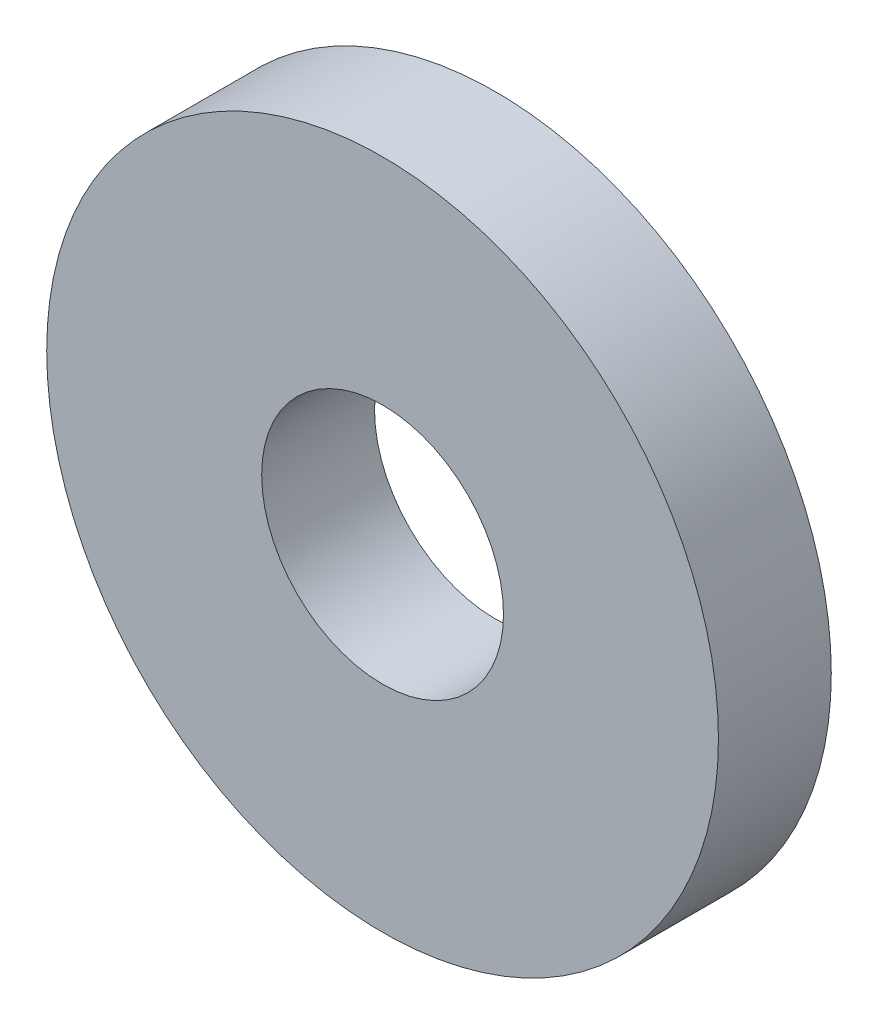
ISO-10303-21;
HEADER;
FILE_DESCRIPTION(('STEP AP214'),'2;1');
FILE_NAME('part.step','',(''),(''),'','','');
FILE_SCHEMA(('AUTOMOTIVE_DESIGN { 1 0 10303 214 1 1 1 1 }'));
ENDSEC;
DATA;
#1=APPLICATION_CONTEXT('core data for automotive mechanical design processes');
#2=APPLICATION_PROTOCOL_DEFINITION('international standard','automotive_design',2000,#1);
#3=PRODUCT_CONTEXT('',#1,'mechanical');
#4=PRODUCT('Part','Part','',(#3));
#5=PRODUCT_RELATED_PRODUCT_CATEGORY('part','',(#4));
#6=PRODUCT_DEFINITION_FORMATION('','',#4);
#7=PRODUCT_DEFINITION_CONTEXT('part definition',#1,'design');
#8=PRODUCT_DEFINITION('design','',#6,#7);
#9=PRODUCT_DEFINITION_SHAPE('','',#8);
#10=(LENGTH_UNIT() NAMED_UNIT(*) SI_UNIT(.MILLI.,.METRE.));
#11=(NAMED_UNIT(*) PLANE_ANGLE_UNIT() SI_UNIT($,.RADIAN.));
#12=(NAMED_UNIT(*) SI_UNIT($,.STERADIAN.) SOLID_ANGLE_UNIT());
#13=UNCERTAINTY_MEASURE_WITH_UNIT(LENGTH_MEASURE(1.E-05),#10,'distance_accuracy_value','');
#14=(GEOMETRIC_REPRESENTATION_CONTEXT(3) GLOBAL_UNCERTAINTY_ASSIGNED_CONTEXT((#13)) GLOBAL_UNIT_ASSIGNED_CONTEXT((#10,
#11,#12)) REPRESENTATION_CONTEXT('',''));
#15=CARTESIAN_POINT('',(0.,0.,0.));
#16=DIRECTION('',(0.,0.,1.));
#17=DIRECTION('',(1.,0.,0.));
#18=AXIS2_PLACEMENT_3D('',#15,#16,#17);
#19=CARTESIAN_POINT('',(0.,0.,3.2004));
#20=DIRECTION('',(0.,0.,1.));
#21=DIRECTION('',(1.,0.,0.));
#22=AXIS2_PLACEMENT_3D('',#19,#20,#21);
#23=PLANE('',#22);
#24=CARTESIAN_POINT('',(0.,0.,3.2004));
#25=DIRECTION('',(0.,0.,1.));
#26=DIRECTION('',(1.,0.,0.));
#27=AXIS2_PLACEMENT_3D('',#24,#25,#26);
#28=CIRCLE('',#27,9.525);
#29=CARTESIAN_POINT('',(9.525,0.,3.2004));
#30=VERTEX_POINT('',#29);
#31=EDGE_CURVE('E10',#30,#30,#28,.T.);
#32=ORIENTED_EDGE('',*,*,#31,.T.);
#33=EDGE_LOOP('',(#32));
#34=FACE_BOUND('',#33,.T.);
#35=CARTESIAN_POINT('',(0.,0.,3.2004));
#36=DIRECTION('',(0.,0.,1.));
#37=DIRECTION('',(1.,0.,0.));
#38=AXIS2_PLACEMENT_3D('',#35,#36,#37);
#39=CIRCLE('',#38,3.429);
#40=CARTESIAN_POINT('',(3.429,0.,3.2004));
#41=VERTEX_POINT('',#40);
#42=EDGE_CURVE('E42',#41,#41,#39,.T.);
#43=ORIENTED_EDGE('',*,*,#42,.F.);
#44=EDGE_LOOP('',(#43));
#45=FACE_BOUND('',#44,.T.);
#46=ADVANCED_FACE('F31',(#34,#45),#23,.T.);
#47=CARTESIAN_POINT('',(0.,0.,0.));
#48=DIRECTION('',(0.,0.,1.));
#49=DIRECTION('',(1.,0.,0.));
#50=AXIS2_PLACEMENT_3D('',#47,#48,#49);
#51=PLANE('',#50);
#52=CARTESIAN_POINT('',(0.,0.,0.));
#53=DIRECTION('',(0.,0.,1.));
#54=DIRECTION('',(1.,0.,0.));
#55=AXIS2_PLACEMENT_3D('',#52,#53,#54);
#56=CIRCLE('',#55,9.525);
#57=CARTESIAN_POINT('',(9.525,0.,0.));
#58=VERTEX_POINT('',#57);
#59=EDGE_CURVE('E35',#58,#58,#56,.T.);
#60=ORIENTED_EDGE('',*,*,#59,.F.);
#61=EDGE_LOOP('',(#60));
#62=FACE_BOUND('',#61,.T.);
#63=CARTESIAN_POINT('',(0.,0.,0.));
#64=DIRECTION('',(0.,0.,1.));
#65=DIRECTION('',(1.,0.,0.));
#66=AXIS2_PLACEMENT_3D('',#63,#64,#65);
#67=CIRCLE('',#66,3.429);
#68=CARTESIAN_POINT('',(3.429,0.,0.));
#69=VERTEX_POINT('',#68);
#70=EDGE_CURVE('E44',#69,#69,#67,.T.);
#71=ORIENTED_EDGE('',*,*,#70,.T.);
#72=EDGE_LOOP('',(#71));
#73=FACE_BOUND('',#72,.T.);
#74=ADVANCED_FACE('F54',(#62,#73),#51,.F.);
#75=CARTESIAN_POINT('',(0.,0.,3.2004));
#76=DIRECTION('',(0.,0.,-1.));
#77=DIRECTION('',(-1.,0.,0.));
#78=AXIS2_PLACEMENT_3D('',#75,#76,#77);
#79=CYLINDRICAL_SURFACE('',#78,9.525);
#80=ORIENTED_EDGE('',*,*,#31,.F.);
#81=EDGE_LOOP('',(#80));
#82=FACE_BOUND('',#81,.T.);
#83=ORIENTED_EDGE('',*,*,#59,.T.);
#84=EDGE_LOOP('',(#83));
#85=FACE_BOUND('',#84,.T.);
#86=ADVANCED_FACE('F33',(#82,#85),#79,.T.);
#87=CARTESIAN_POINT('',(0.,0.,3.2004));
#88=DIRECTION('',(0.,0.,-1.));
#89=DIRECTION('',(-1.,0.,0.));
#90=AXIS2_PLACEMENT_3D('',#87,#88,#89);
#91=CYLINDRICAL_SURFACE('',#90,3.429);
#92=ORIENTED_EDGE('',*,*,#42,.T.);
#93=EDGE_LOOP('',(#92));
#94=FACE_BOUND('',#93,.T.);
#95=ORIENTED_EDGE('',*,*,#70,.F.);
#96=EDGE_LOOP('',(#95));
#97=FACE_BOUND('',#96,.T.);
#98=ADVANCED_FACE('F50',(#94,#97),#91,.F.);
#99=CLOSED_SHELL('',(#46,#74,#86,#98));
#100=MANIFOLD_SOLID_BREP('B2',#99);
#101=ADVANCED_BREP_SHAPE_REPRESENTATION('',(#18,#100),#14);
#102=SHAPE_DEFINITION_REPRESENTATION(#9,#101);
ENDSEC;
END-ISO-10303-21;
